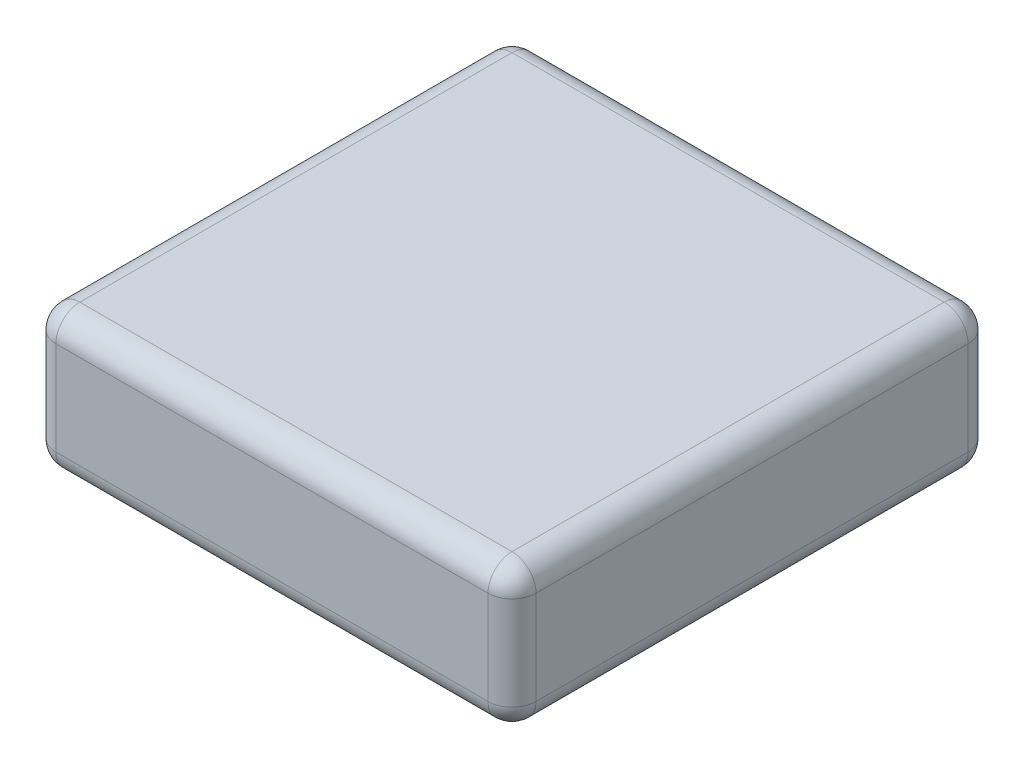
ISO-10303-21;
HEADER;
FILE_DESCRIPTION(('STEP AP214'),'2;1');
FILE_NAME('part.step','',(''),(''),'','','');
FILE_SCHEMA(('AUTOMOTIVE_DESIGN { 1 0 10303 214 1 1 1 1 }'));
ENDSEC;
DATA;
#1=APPLICATION_CONTEXT('core data for automotive mechanical design processes');
#2=APPLICATION_PROTOCOL_DEFINITION('international standard','automotive_design',2000,#1);
#3=PRODUCT_CONTEXT('',#1,'mechanical');
#4=PRODUCT('Part','Part','',(#3));
#5=PRODUCT_RELATED_PRODUCT_CATEGORY('part','',(#4));
#6=PRODUCT_DEFINITION_FORMATION('','',#4);
#7=PRODUCT_DEFINITION_CONTEXT('part definition',#1,'design');
#8=PRODUCT_DEFINITION('design','',#6,#7);
#9=PRODUCT_DEFINITION_SHAPE('','',#8);
#10=(LENGTH_UNIT() NAMED_UNIT(*) SI_UNIT(.MILLI.,.METRE.));
#11=(NAMED_UNIT(*) PLANE_ANGLE_UNIT() SI_UNIT($,.RADIAN.));
#12=(NAMED_UNIT(*) SI_UNIT($,.STERADIAN.) SOLID_ANGLE_UNIT());
#13=UNCERTAINTY_MEASURE_WITH_UNIT(LENGTH_MEASURE(1.E-05),#10,'distance_accuracy_value','');
#14=(GEOMETRIC_REPRESENTATION_CONTEXT(3) GLOBAL_UNCERTAINTY_ASSIGNED_CONTEXT((#13)) GLOBAL_UNIT_ASSIGNED_CONTEXT((#10,
#11,#12)) REPRESENTATION_CONTEXT('',''));
#15=CARTESIAN_POINT('',(0.,0.,0.));
#16=DIRECTION('',(0.,0.,1.));
#17=DIRECTION('',(1.,0.,0.));
#18=AXIS2_PLACEMENT_3D('',#15,#16,#17);
#19=CARTESIAN_POINT('',(0.,15.,0.));
#20=DIRECTION('',(1.,0.,0.));
#21=DIRECTION('',(0.,0.,-1.));
#22=AXIS2_PLACEMENT_3D('',#19,#20,#21);
#23=PLANE('',#22);
#24=DIRECTION('',(0.,0.,1.));
#25=VECTOR('',#24,1.);
#26=CARTESIAN_POINT('',(0.,12.46,0.));
#27=LINE('',#26,#25);
#28=CARTESIAN_POINT('',(0.,12.46,-2.54));
#29=VERTEX_POINT('',#28);
#30=CARTESIAN_POINT('',(0.,12.46,-48.26));
#31=VERTEX_POINT('',#30);
#32=EDGE_CURVE('E142',#29,#31,#27,.F.);
#33=ORIENTED_EDGE('',*,*,#32,.T.);
#34=DIRECTION('',(0.,-1.,0.));
#35=VECTOR('',#34,1.);
#36=CARTESIAN_POINT('',(0.,15.,-48.26));
#37=LINE('',#36,#35);
#38=CARTESIAN_POINT('',(0.,2.54,-48.26));
#39=VERTEX_POINT('',#38);
#40=EDGE_CURVE('E186',#31,#39,#37,.T.);
#41=ORIENTED_EDGE('',*,*,#40,.T.);
#42=DIRECTION('',(0.,0.,1.));
#43=VECTOR('',#42,1.);
#44=CARTESIAN_POINT('',(0.,2.54,0.));
#45=LINE('',#44,#43);
#46=CARTESIAN_POINT('',(0.,2.54,-2.54));
#47=VERTEX_POINT('',#46);
#48=EDGE_CURVE('E177',#39,#47,#45,.T.);
#49=ORIENTED_EDGE('',*,*,#48,.T.);
#50=DIRECTION('',(0.,-1.,0.));
#51=VECTOR('',#50,1.);
#52=CARTESIAN_POINT('',(0.,15.,-2.54));
#53=LINE('',#52,#51);
#54=EDGE_CURVE('E173',#47,#29,#53,.F.);
#55=ORIENTED_EDGE('',*,*,#54,.T.);
#56=EDGE_LOOP('',(#33,#41,#49,#55));
#57=FACE_BOUND('',#56,.T.);
#58=ADVANCED_FACE('F45',(#57),#23,.F.);
#59=CARTESIAN_POINT('',(0.,15.,0.));
#60=DIRECTION('',(0.,0.,-1.));
#61=DIRECTION('',(-1.,0.,0.));
#62=AXIS2_PLACEMENT_3D('',#59,#60,#61);
#63=PLANE('',#62);
#64=DIRECTION('',(1.,0.,0.));
#65=VECTOR('',#64,1.);
#66=CARTESIAN_POINT('',(0.,12.46,0.));
#67=LINE('',#66,#65);
#68=CARTESIAN_POINT('',(48.26,12.46,0.));
#69=VERTEX_POINT('',#68);
#70=CARTESIAN_POINT('',(2.54,12.46,0.));
#71=VERTEX_POINT('',#70);
#72=EDGE_CURVE('E55',#69,#71,#67,.F.);
#73=ORIENTED_EDGE('',*,*,#72,.T.);
#74=DIRECTION('',(0.,-1.,0.));
#75=VECTOR('',#74,1.);
#76=CARTESIAN_POINT('',(2.54,15.,0.));
#77=LINE('',#76,#75);
#78=CARTESIAN_POINT('',(2.54,2.54,0.));
#79=VERTEX_POINT('',#78);
#80=EDGE_CURVE('E11',#71,#79,#77,.T.);
#81=ORIENTED_EDGE('',*,*,#80,.T.);
#82=DIRECTION('',(1.,0.,0.));
#83=VECTOR('',#82,1.);
#84=CARTESIAN_POINT('',(50.8,2.54,0.));
#85=LINE('',#84,#83);
#86=CARTESIAN_POINT('',(48.26,2.54,0.));
#87=VERTEX_POINT('',#86);
#88=EDGE_CURVE('E228',#79,#87,#85,.T.);
#89=ORIENTED_EDGE('',*,*,#88,.T.);
#90=DIRECTION('',(0.,-1.,0.));
#91=VECTOR('',#90,1.);
#92=CARTESIAN_POINT('',(48.26,15.,0.));
#93=LINE('',#92,#91);
#94=EDGE_CURVE('E66',#87,#69,#93,.F.);
#95=ORIENTED_EDGE('',*,*,#94,.T.);
#96=EDGE_LOOP('',(#73,#81,#89,#95));
#97=FACE_BOUND('',#96,.T.);
#98=ADVANCED_FACE('F386',(#97),#63,.F.);
#99=CARTESIAN_POINT('',(50.8,15.,0.));
#100=DIRECTION('',(-1.,0.,0.));
#101=DIRECTION('',(0.,0.,1.));
#102=AXIS2_PLACEMENT_3D('',#99,#100,#101);
#103=PLANE('',#102);
#104=DIRECTION('',(0.,-1.,0.));
#105=VECTOR('',#104,1.);
#106=CARTESIAN_POINT('',(50.8,15.,-48.26));
#107=LINE('',#106,#105);
#108=CARTESIAN_POINT('',(50.8,2.54,-48.26));
#109=VERTEX_POINT('',#108);
#110=CARTESIAN_POINT('',(50.8,12.46,-48.26));
#111=VERTEX_POINT('',#110);
#112=EDGE_CURVE('E221',#109,#111,#107,.F.);
#113=ORIENTED_EDGE('',*,*,#112,.T.);
#114=DIRECTION('',(0.,0.,-1.));
#115=VECTOR('',#114,1.);
#116=CARTESIAN_POINT('',(50.8,12.46,0.));
#117=LINE('',#116,#115);
#118=CARTESIAN_POINT('',(50.8,12.46,-2.54));
#119=VERTEX_POINT('',#118);
#120=EDGE_CURVE('E224',#111,#119,#117,.F.);
#121=ORIENTED_EDGE('',*,*,#120,.T.);
#122=DIRECTION('',(0.,-1.,0.));
#123=VECTOR('',#122,1.);
#124=CARTESIAN_POINT('',(50.8,15.,-2.54));
#125=LINE('',#124,#123);
#126=CARTESIAN_POINT('',(50.8,2.54,-2.54));
#127=VERTEX_POINT('',#126);
#128=EDGE_CURVE('E215',#119,#127,#125,.T.);
#129=ORIENTED_EDGE('',*,*,#128,.T.);
#130=DIRECTION('',(0.,0.,-1.));
#131=VECTOR('',#130,1.);
#132=CARTESIAN_POINT('',(50.8,2.54,-50.8));
#133=LINE('',#132,#131);
#134=EDGE_CURVE('E218',#127,#109,#133,.T.);
#135=ORIENTED_EDGE('',*,*,#134,.T.);
#136=EDGE_LOOP('',(#113,#121,#129,#135));
#137=FACE_BOUND('',#136,.T.);
#138=ADVANCED_FACE('F337',(#137),#103,.F.);
#139=CARTESIAN_POINT('',(0.,15.,-50.8));
#140=DIRECTION('',(0.,0.,1.));
#141=DIRECTION('',(1.,0.,0.));
#142=AXIS2_PLACEMENT_3D('',#139,#140,#141);
#143=PLANE('',#142);
#144=DIRECTION('',(0.,-1.,0.));
#145=VECTOR('',#144,1.);
#146=CARTESIAN_POINT('',(2.54,15.,-50.8));
#147=LINE('',#146,#145);
#148=CARTESIAN_POINT('',(2.54,2.54,-50.8));
#149=VERTEX_POINT('',#148);
#150=CARTESIAN_POINT('',(2.54,12.46,-50.8));
#151=VERTEX_POINT('',#150);
#152=EDGE_CURVE('E208',#149,#151,#147,.F.);
#153=ORIENTED_EDGE('',*,*,#152,.T.);
#154=DIRECTION('',(-1.,0.,0.));
#155=VECTOR('',#154,1.);
#156=CARTESIAN_POINT('',(0.,12.46,-50.8));
#157=LINE('',#156,#155);
#158=CARTESIAN_POINT('',(48.26,12.46,-50.8));
#159=VERTEX_POINT('',#158);
#160=EDGE_CURVE('E211',#151,#159,#157,.F.);
#161=ORIENTED_EDGE('',*,*,#160,.T.);
#162=DIRECTION('',(0.,-1.,0.));
#163=VECTOR('',#162,1.);
#164=CARTESIAN_POINT('',(48.26,15.,-50.8));
#165=LINE('',#164,#163);
#166=CARTESIAN_POINT('',(48.26,2.54,-50.8));
#167=VERTEX_POINT('',#166);
#168=EDGE_CURVE('E202',#159,#167,#165,.T.);
#169=ORIENTED_EDGE('',*,*,#168,.T.);
#170=DIRECTION('',(-1.,0.,0.));
#171=VECTOR('',#170,1.);
#172=CARTESIAN_POINT('',(0.,2.54,-50.8));
#173=LINE('',#172,#171);
#174=EDGE_CURVE('E205',#167,#149,#173,.T.);
#175=ORIENTED_EDGE('',*,*,#174,.T.);
#176=EDGE_LOOP('',(#153,#161,#169,#175));
#177=FACE_BOUND('',#176,.T.);
#178=ADVANCED_FACE('F328',(#177),#143,.F.);
#179=CARTESIAN_POINT('',(0.,15.,0.));
#180=DIRECTION('',(0.,-1.,0.));
#181=DIRECTION('',(0.,0.,-1.));
#182=AXIS2_PLACEMENT_3D('',#179,#180,#181);
#183=PLANE('',#182);
#184=DIRECTION('',(-1.,0.,0.));
#185=VECTOR('',#184,1.);
#186=CARTESIAN_POINT('',(0.,15.,-48.26));
#187=LINE('',#186,#185);
#188=CARTESIAN_POINT('',(48.26,15.,-48.26));
#189=VERTEX_POINT('',#188);
#190=CARTESIAN_POINT('',(2.54,15.,-48.26));
#191=VERTEX_POINT('',#190);
#192=EDGE_CURVE('E170',#189,#191,#187,.T.);
#193=ORIENTED_EDGE('',*,*,#192,.T.);
#194=DIRECTION('',(0.,0.,1.));
#195=VECTOR('',#194,1.);
#196=CARTESIAN_POINT('',(2.54,15.,0.));
#197=LINE('',#196,#195);
#198=CARTESIAN_POINT('',(2.54,15.,-2.54));
#199=VERTEX_POINT('',#198);
#200=EDGE_CURVE('E140',#191,#199,#197,.T.);
#201=ORIENTED_EDGE('',*,*,#200,.T.);
#202=DIRECTION('',(1.,0.,0.));
#203=VECTOR('',#202,1.);
#204=CARTESIAN_POINT('',(0.,15.,-2.54));
#205=LINE('',#204,#203);
#206=CARTESIAN_POINT('',(48.26,15.,-2.54));
#207=VERTEX_POINT('',#206);
#208=EDGE_CURVE('E159',#199,#207,#205,.T.);
#209=ORIENTED_EDGE('',*,*,#208,.T.);
#210=DIRECTION('',(0.,0.,-1.));
#211=VECTOR('',#210,1.);
#212=CARTESIAN_POINT('',(48.26,15.,0.));
#213=LINE('',#212,#211);
#214=EDGE_CURVE('E166',#207,#189,#213,.T.);
#215=ORIENTED_EDGE('',*,*,#214,.T.);
#216=EDGE_LOOP('',(#193,#201,#209,#215));
#217=FACE_BOUND('',#216,.T.);
#218=ADVANCED_FACE('F168',(#217),#183,.F.);
#219=CARTESIAN_POINT('',(0.,0.,0.));
#220=DIRECTION('',(0.,-1.,0.));
#221=DIRECTION('',(0.,0.,-1.));
#222=AXIS2_PLACEMENT_3D('',#219,#220,#221);
#223=PLANE('',#222);
#224=DIRECTION('',(1.,0.,0.));
#225=VECTOR('',#224,1.);
#226=CARTESIAN_POINT('',(0.,0.,-2.54));
#227=LINE('',#226,#225);
#228=CARTESIAN_POINT('',(48.26,0.,-2.54));
#229=VERTEX_POINT('',#228);
#230=CARTESIAN_POINT('',(2.54,0.,-2.54));
#231=VERTEX_POINT('',#230);
#232=EDGE_CURVE('E189',#229,#231,#227,.F.);
#233=ORIENTED_EDGE('',*,*,#232,.T.);
#234=DIRECTION('',(0.,0.,1.));
#235=VECTOR('',#234,1.);
#236=CARTESIAN_POINT('',(2.54,0.,-50.8));
#237=LINE('',#236,#235);
#238=CARTESIAN_POINT('',(2.54,0.,-48.26));
#239=VERTEX_POINT('',#238);
#240=EDGE_CURVE('E198',#231,#239,#237,.F.);
#241=ORIENTED_EDGE('',*,*,#240,.T.);
#242=DIRECTION('',(-1.,0.,0.));
#243=VECTOR('',#242,1.);
#244=CARTESIAN_POINT('',(50.8,0.,-48.26));
#245=LINE('',#244,#243);
#246=CARTESIAN_POINT('',(48.26,0.,-48.26));
#247=VERTEX_POINT('',#246);
#248=EDGE_CURVE('E195',#239,#247,#245,.F.);
#249=ORIENTED_EDGE('',*,*,#248,.T.);
#250=DIRECTION('',(0.,0.,-1.));
#251=VECTOR('',#250,1.);
#252=CARTESIAN_POINT('',(48.26,0.,0.));
#253=LINE('',#252,#251);
#254=EDGE_CURVE('E192',#247,#229,#253,.F.);
#255=ORIENTED_EDGE('',*,*,#254,.T.);
#256=EDGE_LOOP('',(#233,#241,#249,#255));
#257=FACE_BOUND('',#256,.T.);
#258=ADVANCED_FACE('F355',(#257),#223,.T.);
#259=CARTESIAN_POINT('',(48.26,2.54,0.));
#260=DIRECTION('',(0.,0.,1.));
#261=DIRECTION('',(1.,0.,0.));
#262=AXIS2_PLACEMENT_3D('',#259,#260,#261);
#263=CYLINDRICAL_SURFACE('',#262,2.54);
#264=CARTESIAN_POINT('',(48.26,2.54,-48.26));
#265=DIRECTION('',(0.,0.,-1.));
#266=DIRECTION('',(-1.,0.,0.));
#267=AXIS2_PLACEMENT_3D('',#264,#265,#266);
#268=CIRCLE('',#267,2.54);
#269=EDGE_CURVE('E49',#109,#247,#268,.T.);
#270=ORIENTED_EDGE('',*,*,#269,.F.);
#271=ORIENTED_EDGE('',*,*,#134,.F.);
#272=CARTESIAN_POINT('',(48.26,2.54,-2.54));
#273=DIRECTION('',(0.,0.,1.));
#274=DIRECTION('',(1.,0.,0.));
#275=AXIS2_PLACEMENT_3D('',#272,#273,#274);
#276=CIRCLE('',#275,2.54);
#277=EDGE_CURVE('E303',#229,#127,#276,.T.);
#278=ORIENTED_EDGE('',*,*,#277,.F.);
#279=ORIENTED_EDGE('',*,*,#254,.F.);
#280=EDGE_LOOP('',(#270,#271,#278,#279));
#281=FACE_BOUND('',#280,.T.);
#282=ADVANCED_FACE('F47',(#281),#263,.T.);
#283=CARTESIAN_POINT('',(48.26,2.54,-48.26));
#284=DIRECTION('',(0.,-1.,0.));
#285=DIRECTION('',(0.,0.,-1.));
#286=AXIS2_PLACEMENT_3D('',#283,#284,#285);
#287=SPHERICAL_SURFACE('',#286,2.54);
#288=CARTESIAN_POINT('',(48.26,2.54,-48.26));
#289=DIRECTION('',(0.,-1.,0.));
#290=DIRECTION('',(0.,0.,-1.));
#291=AXIS2_PLACEMENT_3D('',#288,#289,#290);
#292=CIRCLE('',#291,2.54);
#293=EDGE_CURVE('E296',#109,#167,#292,.F.);
#294=ORIENTED_EDGE('',*,*,#293,.F.);
#295=ORIENTED_EDGE('',*,*,#269,.T.);
#296=CARTESIAN_POINT('',(48.26,2.54,-48.26));
#297=DIRECTION('',(1.,0.,0.));
#298=DIRECTION('',(0.,0.,-1.));
#299=AXIS2_PLACEMENT_3D('',#296,#297,#298);
#300=CIRCLE('',#299,2.54);
#301=EDGE_CURVE('E300',#167,#247,#300,.F.);
#302=ORIENTED_EDGE('',*,*,#301,.F.);
#303=EDGE_LOOP('',(#294,#295,#302));
#304=FACE_BOUND('',#303,.T.);
#305=ADVANCED_FACE('F316',(#304),#287,.T.);
#306=CARTESIAN_POINT('',(48.26,2.54,-2.54));
#307=DIRECTION('',(1.,0.,0.));
#308=DIRECTION('',(0.,1.,0.));
#309=AXIS2_PLACEMENT_3D('',#306,#307,#308);
#310=SPHERICAL_SURFACE('',#309,2.54);
#311=CARTESIAN_POINT('',(48.26,2.54,-2.54));
#312=DIRECTION('',(1.,0.,0.));
#313=DIRECTION('',(0.,0.,-1.));
#314=AXIS2_PLACEMENT_3D('',#311,#312,#313);
#315=CIRCLE('',#314,2.54);
#316=EDGE_CURVE('E288',#229,#87,#315,.F.);
#317=ORIENTED_EDGE('',*,*,#316,.F.);
#318=ORIENTED_EDGE('',*,*,#277,.T.);
#319=CARTESIAN_POINT('',(48.26,2.54,-2.54));
#320=DIRECTION('',(0.,-1.,0.));
#321=DIRECTION('',(0.,0.,-1.));
#322=AXIS2_PLACEMENT_3D('',#319,#320,#321);
#323=CIRCLE('',#322,2.54);
#324=EDGE_CURVE('E292',#87,#127,#323,.F.);
#325=ORIENTED_EDGE('',*,*,#324,.F.);
#326=EDGE_LOOP('',(#317,#318,#325));
#327=FACE_BOUND('',#326,.T.);
#328=ADVANCED_FACE('F348',(#327),#310,.T.);
#329=CARTESIAN_POINT('',(0.,2.54,-48.26));
#330=DIRECTION('',(1.,0.,0.));
#331=DIRECTION('',(0.,0.,-1.));
#332=AXIS2_PLACEMENT_3D('',#329,#330,#331);
#333=CYLINDRICAL_SURFACE('',#332,2.54);
#334=ORIENTED_EDGE('',*,*,#301,.T.);
#335=ORIENTED_EDGE('',*,*,#248,.F.);
#336=CARTESIAN_POINT('',(2.54,2.54,-48.26));
#337=DIRECTION('',(-1.,0.,0.));
#338=DIRECTION('',(0.,0.,1.));
#339=AXIS2_PLACEMENT_3D('',#336,#337,#338);
#340=CIRCLE('',#339,2.54);
#341=EDGE_CURVE('E281',#149,#239,#340,.T.);
#342=ORIENTED_EDGE('',*,*,#341,.F.);
#343=ORIENTED_EDGE('',*,*,#174,.F.);
#344=EDGE_LOOP('',(#334,#335,#342,#343));
#345=FACE_BOUND('',#344,.T.);
#346=ADVANCED_FACE('F324',(#345),#333,.T.);
#347=CARTESIAN_POINT('',(48.26,15.,-48.26));
#348=DIRECTION('',(0.,-1.,0.));
#349=DIRECTION('',(0.,0.,-1.));
#350=AXIS2_PLACEMENT_3D('',#347,#348,#349);
#351=CYLINDRICAL_SURFACE('',#350,2.54);
#352=ORIENTED_EDGE('',*,*,#293,.T.);
#353=ORIENTED_EDGE('',*,*,#168,.F.);
#354=CARTESIAN_POINT('',(48.26,12.46,-48.26));
#355=DIRECTION('',(0.,1.,0.));
#356=DIRECTION('',(0.,0.,1.));
#357=AXIS2_PLACEMENT_3D('',#354,#355,#356);
#358=CIRCLE('',#357,2.54);
#359=EDGE_CURVE('E277',#111,#159,#358,.T.);
#360=ORIENTED_EDGE('',*,*,#359,.F.);
#361=ORIENTED_EDGE('',*,*,#112,.F.);
#362=EDGE_LOOP('',(#352,#353,#360,#361));
#363=FACE_BOUND('',#362,.T.);
#364=ADVANCED_FACE('F334',(#363),#351,.T.);
#365=CARTESIAN_POINT('',(48.26,12.46,0.));
#366=DIRECTION('',(0.,0.,-1.));
#367=DIRECTION('',(-1.,0.,0.));
#368=AXIS2_PLACEMENT_3D('',#365,#366,#367);
#369=CYLINDRICAL_SURFACE('',#368,2.54);
#370=CARTESIAN_POINT('',(48.26,12.46,-2.54));
#371=DIRECTION('',(0.,0.,1.));
#372=DIRECTION('',(1.,0.,0.));
#373=AXIS2_PLACEMENT_3D('',#370,#371,#372);
#374=CIRCLE('',#373,2.54);
#375=EDGE_CURVE('E269',#119,#207,#374,.T.);
#376=ORIENTED_EDGE('',*,*,#375,.F.);
#377=ORIENTED_EDGE('',*,*,#120,.F.);
#378=CARTESIAN_POINT('',(48.26,12.46,-48.26));
#379=DIRECTION('',(0.,0.,-1.));
#380=DIRECTION('',(-1.,0.,0.));
#381=AXIS2_PLACEMENT_3D('',#378,#379,#380);
#382=CIRCLE('',#381,2.54);
#383=EDGE_CURVE('E273',#189,#111,#382,.T.);
#384=ORIENTED_EDGE('',*,*,#383,.F.);
#385=ORIENTED_EDGE('',*,*,#214,.F.);
#386=EDGE_LOOP('',(#376,#377,#384,#385));
#387=FACE_BOUND('',#386,.T.);
#388=ADVANCED_FACE('F341',(#387),#369,.T.);
#389=CARTESIAN_POINT('',(48.26,15.,-2.54));
#390=DIRECTION('',(0.,-1.,0.));
#391=DIRECTION('',(0.,0.,-1.));
#392=AXIS2_PLACEMENT_3D('',#389,#390,#391);
#393=CYLINDRICAL_SURFACE('',#392,2.54);
#394=ORIENTED_EDGE('',*,*,#324,.T.);
#395=ORIENTED_EDGE('',*,*,#128,.F.);
#396=CARTESIAN_POINT('',(48.26,12.46,-2.54));
#397=DIRECTION('',(0.,1.,0.));
#398=DIRECTION('',(0.,0.,1.));
#399=AXIS2_PLACEMENT_3D('',#396,#397,#398);
#400=CIRCLE('',#399,2.54);
#401=EDGE_CURVE('E266',#69,#119,#400,.T.);
#402=ORIENTED_EDGE('',*,*,#401,.F.);
#403=ORIENTED_EDGE('',*,*,#94,.F.);
#404=EDGE_LOOP('',(#394,#395,#402,#403));
#405=FACE_BOUND('',#404,.T.);
#406=ADVANCED_FACE('F346',(#405),#393,.T.);
#407=CARTESIAN_POINT('',(0.,2.54,-2.54));
#408=DIRECTION('',(-1.,0.,0.));
#409=DIRECTION('',(0.,0.,1.));
#410=AXIS2_PLACEMENT_3D('',#407,#408,#409);
#411=CYLINDRICAL_SURFACE('',#410,2.54);
#412=ORIENTED_EDGE('',*,*,#316,.T.);
#413=ORIENTED_EDGE('',*,*,#88,.F.);
#414=CARTESIAN_POINT('',(2.54,2.54,-2.54));
#415=DIRECTION('',(-1.,0.,0.));
#416=DIRECTION('',(0.,0.,1.));
#417=AXIS2_PLACEMENT_3D('',#414,#415,#416);
#418=CIRCLE('',#417,2.54);
#419=EDGE_CURVE('E262',#231,#79,#418,.T.);
#420=ORIENTED_EDGE('',*,*,#419,.F.);
#421=ORIENTED_EDGE('',*,*,#232,.F.);
#422=EDGE_LOOP('',(#412,#413,#420,#421));
#423=FACE_BOUND('',#422,.T.);
#424=ADVANCED_FACE('F352',(#423),#411,.T.);
#425=CARTESIAN_POINT('',(2.54,2.54,0.));
#426=DIRECTION('',(0.,0.,-1.));
#427=DIRECTION('',(-1.,0.,0.));
#428=AXIS2_PLACEMENT_3D('',#425,#426,#427);
#429=CYLINDRICAL_SURFACE('',#428,2.54);
#430=CARTESIAN_POINT('',(2.54,2.54,-48.26));
#431=DIRECTION('',(0.,0.,-1.));
#432=DIRECTION('',(-1.,0.,0.));
#433=AXIS2_PLACEMENT_3D('',#430,#431,#432);
#434=CIRCLE('',#433,2.54);
#435=EDGE_CURVE('E284',#239,#39,#434,.T.);
#436=ORIENTED_EDGE('',*,*,#435,.F.);
#437=ORIENTED_EDGE('',*,*,#240,.F.);
#438=CARTESIAN_POINT('',(2.54,2.54,-2.54));
#439=DIRECTION('',(0.,0.,1.));
#440=DIRECTION('',(1.,0.,0.));
#441=AXIS2_PLACEMENT_3D('',#438,#439,#440);
#442=CIRCLE('',#441,2.54);
#443=EDGE_CURVE('E258',#47,#231,#442,.T.);
#444=ORIENTED_EDGE('',*,*,#443,.F.);
#445=ORIENTED_EDGE('',*,*,#48,.F.);
#446=EDGE_LOOP('',(#436,#437,#444,#445));
#447=FACE_BOUND('',#446,.T.);
#448=ADVANCED_FACE('F359',(#447),#429,.T.);
#449=CARTESIAN_POINT('',(2.54,2.54,-48.26));
#450=DIRECTION('',(0.,-1.,0.));
#451=DIRECTION('',(0.,0.,-1.));
#452=AXIS2_PLACEMENT_3D('',#449,#450,#451);
#453=SPHERICAL_SURFACE('',#452,2.54);
#454=ORIENTED_EDGE('',*,*,#341,.T.);
#455=ORIENTED_EDGE('',*,*,#435,.T.);
#456=CARTESIAN_POINT('',(2.54,2.54,-48.26));
#457=DIRECTION('',(0.,-1.,0.));
#458=DIRECTION('',(0.,0.,-1.));
#459=AXIS2_PLACEMENT_3D('',#456,#457,#458);
#460=CIRCLE('',#459,2.54);
#461=EDGE_CURVE('E254',#149,#39,#460,.F.);
#462=ORIENTED_EDGE('',*,*,#461,.F.);
#463=EDGE_LOOP('',(#454,#455,#462));
#464=FACE_BOUND('',#463,.T.);
#465=ADVANCED_FACE('F363',(#464),#453,.T.);
#466=CARTESIAN_POINT('',(48.26,12.46,-48.26));
#467=DIRECTION('',(1.,0.,0.));
#468=DIRECTION('',(0.,0.,-1.));
#469=AXIS2_PLACEMENT_3D('',#466,#467,#468);
#470=SPHERICAL_SURFACE('',#469,2.54);
#471=ORIENTED_EDGE('',*,*,#383,.T.);
#472=ORIENTED_EDGE('',*,*,#359,.T.);
#473=CARTESIAN_POINT('',(48.26,12.46,-48.26));
#474=DIRECTION('',(1.,0.,0.));
#475=DIRECTION('',(0.,0.,-1.));
#476=AXIS2_PLACEMENT_3D('',#473,#474,#475);
#477=CIRCLE('',#476,2.54);
#478=EDGE_CURVE('E251',#189,#159,#477,.F.);
#479=ORIENTED_EDGE('',*,*,#478,.F.);
#480=EDGE_LOOP('',(#471,#472,#479));
#481=FACE_BOUND('',#480,.T.);
#482=ADVANCED_FACE('F374',(#481),#470,.T.);
#483=CARTESIAN_POINT('',(48.26,12.46,-2.54));
#484=DIRECTION('',(1.,0.,0.));
#485=DIRECTION('',(0.,0.,-1.));
#486=AXIS2_PLACEMENT_3D('',#483,#484,#485);
#487=SPHERICAL_SURFACE('',#486,2.54);
#488=ORIENTED_EDGE('',*,*,#401,.T.);
#489=ORIENTED_EDGE('',*,*,#375,.T.);
#490=CARTESIAN_POINT('',(48.26,12.46,-2.54));
#491=DIRECTION('',(1.,0.,0.));
#492=DIRECTION('',(0.,0.,-1.));
#493=AXIS2_PLACEMENT_3D('',#490,#491,#492);
#494=CIRCLE('',#493,2.54);
#495=EDGE_CURVE('E162',#69,#207,#494,.F.);
#496=ORIENTED_EDGE('',*,*,#495,.F.);
#497=EDGE_LOOP('',(#488,#489,#496));
#498=FACE_BOUND('',#497,.T.);
#499=ADVANCED_FACE('F376',(#498),#487,.T.);
#500=CARTESIAN_POINT('',(2.54,2.54,-2.54));
#501=DIRECTION('',(0.,-1.,0.));
#502=DIRECTION('',(0.,0.,-1.));
#503=AXIS2_PLACEMENT_3D('',#500,#501,#502);
#504=SPHERICAL_SURFACE('',#503,2.54);
#505=ORIENTED_EDGE('',*,*,#443,.T.);
#506=ORIENTED_EDGE('',*,*,#419,.T.);
#507=CARTESIAN_POINT('',(2.54,2.54,-2.54));
#508=DIRECTION('',(0.,-1.,0.));
#509=DIRECTION('',(0.,0.,-1.));
#510=AXIS2_PLACEMENT_3D('',#507,#508,#509);
#511=CIRCLE('',#510,2.54);
#512=EDGE_CURVE('E246',#47,#79,#511,.F.);
#513=ORIENTED_EDGE('',*,*,#512,.F.);
#514=EDGE_LOOP('',(#505,#506,#513));
#515=FACE_BOUND('',#514,.T.);
#516=ADVANCED_FACE('F382',(#515),#504,.T.);
#517=CARTESIAN_POINT('',(2.54,15.,-48.26));
#518=DIRECTION('',(0.,-1.,0.));
#519=DIRECTION('',(0.,0.,-1.));
#520=AXIS2_PLACEMENT_3D('',#517,#518,#519);
#521=CYLINDRICAL_SURFACE('',#520,2.54);
#522=ORIENTED_EDGE('',*,*,#461,.T.);
#523=ORIENTED_EDGE('',*,*,#40,.F.);
#524=CARTESIAN_POINT('',(2.54,12.46,-48.26));
#525=DIRECTION('',(0.,1.,0.));
#526=DIRECTION('',(0.,0.,1.));
#527=AXIS2_PLACEMENT_3D('',#524,#525,#526);
#528=CIRCLE('',#527,2.54);
#529=EDGE_CURVE('E242',#151,#31,#528,.T.);
#530=ORIENTED_EDGE('',*,*,#529,.F.);
#531=ORIENTED_EDGE('',*,*,#152,.F.);
#532=EDGE_LOOP('',(#522,#523,#530,#531));
#533=FACE_BOUND('',#532,.T.);
#534=ADVANCED_FACE('F366',(#533),#521,.T.);
#535=CARTESIAN_POINT('',(0.,12.46,-48.26));
#536=DIRECTION('',(-1.,0.,0.));
#537=DIRECTION('',(0.,0.,1.));
#538=AXIS2_PLACEMENT_3D('',#535,#536,#537);
#539=CYLINDRICAL_SURFACE('',#538,2.54);
#540=ORIENTED_EDGE('',*,*,#478,.T.);
#541=ORIENTED_EDGE('',*,*,#160,.F.);
#542=CARTESIAN_POINT('',(2.54,12.46,-48.26));
#543=DIRECTION('',(-1.,0.,0.));
#544=DIRECTION('',(0.,0.,1.));
#545=AXIS2_PLACEMENT_3D('',#542,#543,#544);
#546=CIRCLE('',#545,2.54);
#547=EDGE_CURVE('E156',#191,#151,#546,.T.);
#548=ORIENTED_EDGE('',*,*,#547,.F.);
#549=ORIENTED_EDGE('',*,*,#192,.F.);
#550=EDGE_LOOP('',(#540,#541,#548,#549));
#551=FACE_BOUND('',#550,.T.);
#552=ADVANCED_FACE('F372',(#551),#539,.T.);
#553=CARTESIAN_POINT('',(0.,12.46,-2.54));
#554=DIRECTION('',(1.,0.,0.));
#555=DIRECTION('',(0.,0.,-1.));
#556=AXIS2_PLACEMENT_3D('',#553,#554,#555);
#557=CYLINDRICAL_SURFACE('',#556,2.54);
#558=ORIENTED_EDGE('',*,*,#495,.T.);
#559=ORIENTED_EDGE('',*,*,#208,.F.);
#560=CARTESIAN_POINT('',(2.54,12.46,-2.54));
#561=DIRECTION('',(-1.,0.,0.));
#562=DIRECTION('',(0.,0.,1.));
#563=AXIS2_PLACEMENT_3D('',#560,#561,#562);
#564=CIRCLE('',#563,2.54);
#565=EDGE_CURVE('E149',#71,#199,#564,.T.);
#566=ORIENTED_EDGE('',*,*,#565,.F.);
#567=ORIENTED_EDGE('',*,*,#72,.F.);
#568=EDGE_LOOP('',(#558,#559,#566,#567));
#569=FACE_BOUND('',#568,.T.);
#570=ADVANCED_FACE('F160',(#569),#557,.T.);
#571=CARTESIAN_POINT('',(2.54,15.,-2.54));
#572=DIRECTION('',(0.,-1.,0.));
#573=DIRECTION('',(0.,0.,-1.));
#574=AXIS2_PLACEMENT_3D('',#571,#572,#573);
#575=CYLINDRICAL_SURFACE('',#574,2.54);
#576=ORIENTED_EDGE('',*,*,#512,.T.);
#577=ORIENTED_EDGE('',*,*,#80,.F.);
#578=CARTESIAN_POINT('',(2.54,12.46,-2.54));
#579=DIRECTION('',(0.,1.,0.));
#580=DIRECTION('',(0.,0.,1.));
#581=AXIS2_PLACEMENT_3D('',#578,#579,#580);
#582=CIRCLE('',#581,2.54);
#583=EDGE_CURVE('E153',#29,#71,#582,.T.);
#584=ORIENTED_EDGE('',*,*,#583,.F.);
#585=ORIENTED_EDGE('',*,*,#54,.F.);
#586=EDGE_LOOP('',(#576,#577,#584,#585));
#587=FACE_BOUND('',#586,.T.);
#588=ADVANCED_FACE('F401',(#587),#575,.T.);
#589=CARTESIAN_POINT('',(2.54,12.46,-48.26));
#590=DIRECTION('',(0.,0.,-1.));
#591=DIRECTION('',(-1.,0.,0.));
#592=AXIS2_PLACEMENT_3D('',#589,#590,#591);
#593=SPHERICAL_SURFACE('',#592,2.54);
#594=ORIENTED_EDGE('',*,*,#547,.T.);
#595=ORIENTED_EDGE('',*,*,#529,.T.);
#596=CARTESIAN_POINT('',(2.54,12.46,-48.26));
#597=DIRECTION('',(0.,0.,-1.));
#598=DIRECTION('',(-1.,0.,0.));
#599=AXIS2_PLACEMENT_3D('',#596,#597,#598);
#600=CIRCLE('',#599,2.54);
#601=EDGE_CURVE('E146',#191,#31,#600,.F.);
#602=ORIENTED_EDGE('',*,*,#601,.F.);
#603=EDGE_LOOP('',(#594,#595,#602));
#604=FACE_BOUND('',#603,.T.);
#605=ADVANCED_FACE('F370',(#604),#593,.T.);
#606=CARTESIAN_POINT('',(2.54,12.46,-2.54));
#607=DIRECTION('',(0.,0.,1.));
#608=DIRECTION('',(1.,0.,0.));
#609=AXIS2_PLACEMENT_3D('',#606,#607,#608);
#610=SPHERICAL_SURFACE('',#609,2.54);
#611=ORIENTED_EDGE('',*,*,#583,.T.);
#612=ORIENTED_EDGE('',*,*,#565,.T.);
#613=CARTESIAN_POINT('',(2.54,12.46,-2.54));
#614=DIRECTION('',(0.,0.,1.));
#615=DIRECTION('',(1.,0.,0.));
#616=AXIS2_PLACEMENT_3D('',#613,#614,#615);
#617=CIRCLE('',#616,2.54);
#618=EDGE_CURVE('E136',#29,#199,#617,.F.);
#619=ORIENTED_EDGE('',*,*,#618,.F.);
#620=EDGE_LOOP('',(#611,#612,#619));
#621=FACE_BOUND('',#620,.T.);
#622=ADVANCED_FACE('F151',(#621),#610,.T.);
#623=CARTESIAN_POINT('',(2.54,12.46,0.));
#624=DIRECTION('',(0.,0.,1.));
#625=DIRECTION('',(1.,0.,0.));
#626=AXIS2_PLACEMENT_3D('',#623,#624,#625);
#627=CYLINDRICAL_SURFACE('',#626,2.54);
#628=ORIENTED_EDGE('',*,*,#601,.T.);
#629=ORIENTED_EDGE('',*,*,#32,.F.);
#630=ORIENTED_EDGE('',*,*,#618,.T.);
#631=ORIENTED_EDGE('',*,*,#200,.F.);
#632=EDGE_LOOP('',(#628,#629,#630,#631));
#633=FACE_BOUND('',#632,.T.);
#634=ADVANCED_FACE('F138',(#633),#627,.T.);
#635=CLOSED_SHELL('',(#58,#98,#138,#178,#218,#258,#282,#305,#328,#346,#364,#388,#406,#424,#448,
#465,#482,#499,#516,#534,#552,#570,#588,#605,#622,#634));
#636=MANIFOLD_SOLID_BREP('B2',#635);
#637=ADVANCED_BREP_SHAPE_REPRESENTATION('',(#18,#636),#14);
#638=SHAPE_DEFINITION_REPRESENTATION(#9,#637);
ENDSEC;
END-ISO-10303-21;
